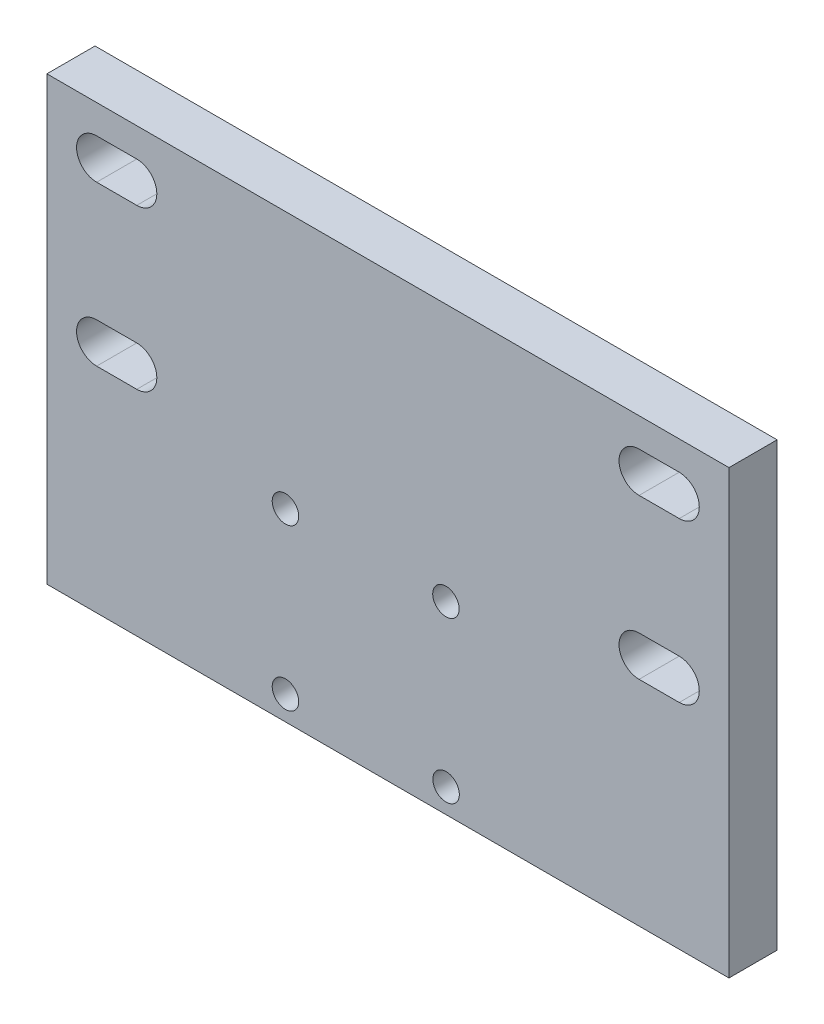
ISO-10303-21;
HEADER;
FILE_DESCRIPTION(('STEP AP214'),'2;1');
FILE_NAME('part.step','',(''),(''),'','','');
FILE_SCHEMA(('AUTOMOTIVE_DESIGN { 1 0 10303 214 1 1 1 1 }'));
ENDSEC;
DATA;
#1=APPLICATION_CONTEXT('core data for automotive mechanical design processes');
#2=APPLICATION_PROTOCOL_DEFINITION('international standard','automotive_design',2000,#1);
#3=PRODUCT_CONTEXT('',#1,'mechanical');
#4=PRODUCT('Part','Part','',(#3));
#5=PRODUCT_RELATED_PRODUCT_CATEGORY('part','',(#4));
#6=PRODUCT_DEFINITION_FORMATION('','',#4);
#7=PRODUCT_DEFINITION_CONTEXT('part definition',#1,'design');
#8=PRODUCT_DEFINITION('design','',#6,#7);
#9=PRODUCT_DEFINITION_SHAPE('','',#8);
#10=(LENGTH_UNIT() NAMED_UNIT(*) SI_UNIT(.MILLI.,.METRE.));
#11=(NAMED_UNIT(*) PLANE_ANGLE_UNIT() SI_UNIT($,.RADIAN.));
#12=(NAMED_UNIT(*) SI_UNIT($,.STERADIAN.) SOLID_ANGLE_UNIT());
#13=UNCERTAINTY_MEASURE_WITH_UNIT(LENGTH_MEASURE(1.E-05),#10,'distance_accuracy_value','');
#14=(GEOMETRIC_REPRESENTATION_CONTEXT(3) GLOBAL_UNCERTAINTY_ASSIGNED_CONTEXT((#13)) GLOBAL_UNIT_ASSIGNED_CONTEXT((#10,
#11,#12)) REPRESENTATION_CONTEXT('',''));
#15=CARTESIAN_POINT('',(0.,0.,0.));
#16=DIRECTION('',(0.,0.,1.));
#17=DIRECTION('',(1.,0.,0.));
#18=AXIS2_PLACEMENT_3D('',#15,#16,#17);
#19=CARTESIAN_POINT('',(0.,0.,6.));
#20=DIRECTION('',(0.,0.,1.));
#21=DIRECTION('',(1.,0.,0.));
#22=AXIS2_PLACEMENT_3D('',#19,#20,#21);
#23=PLANE('',#22);
#24=CARTESIAN_POINT('',(-10.2687894607377,-36.1316136019067,6.));
#25=DIRECTION('',(0.,0.,1.));
#26=DIRECTION('',(1.,0.,0.));
#27=AXIS2_PLACEMENT_3D('',#24,#25,#26);
#28=CIRCLE('',#27,1.65);
#29=CARTESIAN_POINT('',(-8.61878946073774,-36.1316136019067,6.));
#30=VERTEX_POINT('',#29);
#31=EDGE_CURVE('E324',#30,#30,#28,.T.);
#32=ORIENTED_EDGE('',*,*,#31,.F.);
#33=EDGE_LOOP('',(#32));
#34=FACE_BOUND('',#33,.T.);
#35=CARTESIAN_POINT('',(-10.2687894607377,-16.1316136019067,6.));
#36=DIRECTION('',(0.,0.,1.));
#37=DIRECTION('',(1.,0.,0.));
#38=AXIS2_PLACEMENT_3D('',#35,#36,#37);
#39=CIRCLE('',#38,1.65);
#40=CARTESIAN_POINT('',(-8.61878946073774,-16.1316136019067,6.));
#41=VERTEX_POINT('',#40);
#42=EDGE_CURVE('E325',#41,#41,#39,.T.);
#43=ORIENTED_EDGE('',*,*,#42,.F.);
#44=EDGE_LOOP('',(#43));
#45=FACE_BOUND('',#44,.T.);
#46=DIRECTION('',(0.,-1.,0.));
#47=VECTOR('',#46,1.);
#48=CARTESIAN_POINT('',(-40.,15.9473463451879,6.));
#49=LINE('',#48,#47);
#50=CARTESIAN_POINT('',(-40.,15.9473463451879,6.));
#51=VERTEX_POINT('',#50);
#52=CARTESIAN_POINT('',(-40.,-39.1363463064482,6.));
#53=VERTEX_POINT('',#52);
#54=EDGE_CURVE('E339',#51,#53,#49,.T.);
#55=ORIENTED_EDGE('',*,*,#54,.T.);
#56=DIRECTION('',(1.,0.,0.));
#57=VECTOR('',#56,1.);
#58=CARTESIAN_POINT('',(-40.,-39.1363463064482,6.));
#59=LINE('',#58,#57);
#60=CARTESIAN_POINT('',(45.,-39.1363463064482,6.));
#61=VERTEX_POINT('',#60);
#62=EDGE_CURVE('E344',#53,#61,#59,.T.);
#63=ORIENTED_EDGE('',*,*,#62,.T.);
#64=DIRECTION('',(0.,1.,0.));
#65=VECTOR('',#64,1.);
#66=CARTESIAN_POINT('',(45.,15.9473463451879,6.));
#67=LINE('',#66,#65);
#68=CARTESIAN_POINT('',(45.,15.9473463451879,6.));
#69=VERTEX_POINT('',#68);
#70=EDGE_CURVE('E351',#61,#69,#67,.T.);
#71=ORIENTED_EDGE('',*,*,#70,.T.);
#72=DIRECTION('',(-1.,0.,0.));
#73=VECTOR('',#72,1.);
#74=CARTESIAN_POINT('',(-40.,15.9473463451879,6.));
#75=LINE('',#74,#73);
#76=EDGE_CURVE('E355',#69,#51,#75,.T.);
#77=ORIENTED_EDGE('',*,*,#76,.T.);
#78=EDGE_LOOP('',(#55,#63,#71,#77));
#79=FACE_BOUND('',#78,.T.);
#80=DIRECTION('',(-1.,0.,0.));
#81=VECTOR('',#80,1.);
#82=CARTESIAN_POINT('',(38.8,12.35,6.));
#83=LINE('',#82,#81);
#84=CARTESIAN_POINT('',(38.8,12.35,6.));
#85=VERTEX_POINT('',#84);
#86=CARTESIAN_POINT('',(33.8,12.35,6.));
#87=VERTEX_POINT('',#86);
#88=EDGE_CURVE('E362',#85,#87,#83,.T.);
#89=ORIENTED_EDGE('',*,*,#88,.F.);
#90=CARTESIAN_POINT('',(38.8,9.85000000000004,6.));
#91=DIRECTION('',(0.,0.,1.));
#92=DIRECTION('',(-1.,0.,0.));
#93=AXIS2_PLACEMENT_3D('',#90,#91,#92);
#94=CIRCLE('',#93,2.50000000000001);
#95=CARTESIAN_POINT('',(38.8,7.35000000000001,6.));
#96=VERTEX_POINT('',#95);
#97=EDGE_CURVE('E366',#96,#85,#94,.T.);
#98=ORIENTED_EDGE('',*,*,#97,.F.);
#99=DIRECTION('',(1.,0.,0.));
#100=VECTOR('',#99,1.);
#101=CARTESIAN_POINT('',(38.8,7.35000000000001,6.));
#102=LINE('',#101,#100);
#103=CARTESIAN_POINT('',(33.8,7.35000000000001,6.));
#104=VERTEX_POINT('',#103);
#105=EDGE_CURVE('E372',#104,#96,#102,.T.);
#106=ORIENTED_EDGE('',*,*,#105,.F.);
#107=CARTESIAN_POINT('',(33.8,9.85000000000004,6.));
#108=DIRECTION('',(0.,0.,1.));
#109=DIRECTION('',(-1.,0.,0.));
#110=AXIS2_PLACEMENT_3D('',#107,#108,#109);
#111=CIRCLE('',#110,2.50000000000001);
#112=EDGE_CURVE('E365',#87,#104,#111,.T.);
#113=ORIENTED_EDGE('',*,*,#112,.F.);
#114=EDGE_LOOP('',(#89,#98,#106,#113));
#115=FACE_BOUND('',#114,.T.);
#116=CARTESIAN_POINT('',(9.73121053926226,-16.1316136019067,6.));
#117=DIRECTION('',(0.,0.,1.));
#118=DIRECTION('',(1.,0.,0.));
#119=AXIS2_PLACEMENT_3D('',#116,#117,#118);
#120=CIRCLE('',#119,1.65);
#121=CARTESIAN_POINT('',(11.3812105392623,-16.1316136019067,6.));
#122=VERTEX_POINT('',#121);
#123=EDGE_CURVE('E314',#122,#122,#120,.T.);
#124=ORIENTED_EDGE('',*,*,#123,.F.);
#125=EDGE_LOOP('',(#124));
#126=FACE_BOUND('',#125,.T.);
#127=CARTESIAN_POINT('',(9.74773228175577,-36.1316136019067,6.));
#128=DIRECTION('',(0.,0.,1.));
#129=DIRECTION('',(1.,0.,0.));
#130=AXIS2_PLACEMENT_3D('',#127,#128,#129);
#131=CIRCLE('',#130,1.65);
#132=CARTESIAN_POINT('',(11.3977322817558,-36.1316136019067,6.));
#133=VERTEX_POINT('',#132);
#134=EDGE_CURVE('E302',#133,#133,#131,.T.);
#135=ORIENTED_EDGE('',*,*,#134,.F.);
#136=EDGE_LOOP('',(#135));
#137=FACE_BOUND('',#136,.T.);
#138=DIRECTION('',(1.,0.,0.));
#139=VECTOR('',#138,1.);
#140=CARTESIAN_POINT('',(-33.8,7.35,6.));
#141=LINE('',#140,#139);
#142=CARTESIAN_POINT('',(-33.8,7.35,6.));
#143=VERTEX_POINT('',#142);
#144=CARTESIAN_POINT('',(-28.8,7.35000000000002,6.));
#145=VERTEX_POINT('',#144);
#146=EDGE_CURVE('E266',#143,#145,#141,.T.);
#147=ORIENTED_EDGE('',*,*,#146,.F.);
#148=CARTESIAN_POINT('',(-33.8,9.85000000000001,6.));
#149=DIRECTION('',(0.,0.,1.));
#150=DIRECTION('',(1.,0.,0.));
#151=AXIS2_PLACEMENT_3D('',#148,#149,#150);
#152=CIRCLE('',#151,2.50000000000001);
#153=CARTESIAN_POINT('',(-33.8,12.35,6.));
#154=VERTEX_POINT('',#153);
#155=EDGE_CURVE('E262',#154,#143,#152,.T.);
#156=ORIENTED_EDGE('',*,*,#155,.F.);
#157=DIRECTION('',(-1.,0.,0.));
#158=VECTOR('',#157,1.);
#159=CARTESIAN_POINT('',(-33.8,12.35,6.));
#160=LINE('',#159,#158);
#161=CARTESIAN_POINT('',(-28.8,12.35,6.));
#162=VERTEX_POINT('',#161);
#163=EDGE_CURVE('E275',#162,#154,#160,.T.);
#164=ORIENTED_EDGE('',*,*,#163,.F.);
#165=CARTESIAN_POINT('',(-28.8,9.85000000000003,6.));
#166=DIRECTION('',(0.,0.,1.));
#167=DIRECTION('',(1.,0.,0.));
#168=AXIS2_PLACEMENT_3D('',#165,#166,#167);
#169=CIRCLE('',#168,2.50000000000001);
#170=EDGE_CURVE('E280',#145,#162,#169,.T.);
#171=ORIENTED_EDGE('',*,*,#170,.F.);
#172=EDGE_LOOP('',(#147,#156,#164,#171));
#173=FACE_BOUND('',#172,.T.);
#174=DIRECTION('',(1.,0.,0.));
#175=VECTOR('',#174,1.);
#176=CARTESIAN_POINT('',(-33.8,-12.5,6.));
#177=LINE('',#176,#175);
#178=CARTESIAN_POINT('',(-33.8,-12.5,6.));
#179=VERTEX_POINT('',#178);
#180=CARTESIAN_POINT('',(-28.8,-12.5,6.));
#181=VERTEX_POINT('',#180);
#182=EDGE_CURVE('E228',#179,#181,#177,.T.);
#183=ORIENTED_EDGE('',*,*,#182,.F.);
#184=CARTESIAN_POINT('',(-33.8,-9.99999999999999,6.));
#185=DIRECTION('',(0.,0.,1.));
#186=DIRECTION('',(1.,0.,0.));
#187=AXIS2_PLACEMENT_3D('',#184,#185,#186);
#188=CIRCLE('',#187,2.5);
#189=CARTESIAN_POINT('',(-33.8,-7.5,6.));
#190=VERTEX_POINT('',#189);
#191=EDGE_CURVE('E224',#190,#179,#188,.T.);
#192=ORIENTED_EDGE('',*,*,#191,.F.);
#193=DIRECTION('',(-1.,0.,0.));
#194=VECTOR('',#193,1.);
#195=CARTESIAN_POINT('',(-33.8,-7.5,6.));
#196=LINE('',#195,#194);
#197=CARTESIAN_POINT('',(-28.8,-7.49999999999999,6.));
#198=VERTEX_POINT('',#197);
#199=EDGE_CURVE('E235',#198,#190,#196,.T.);
#200=ORIENTED_EDGE('',*,*,#199,.F.);
#201=CARTESIAN_POINT('',(-28.8,-9.99999999999999,6.));
#202=DIRECTION('',(0.,0.,1.));
#203=DIRECTION('',(1.,0.,0.));
#204=AXIS2_PLACEMENT_3D('',#201,#202,#203);
#205=CIRCLE('',#204,2.5);
#206=EDGE_CURVE('E240',#181,#198,#205,.T.);
#207=ORIENTED_EDGE('',*,*,#206,.F.);
#208=EDGE_LOOP('',(#183,#192,#200,#207));
#209=FACE_BOUND('',#208,.T.);
#210=DIRECTION('',(-1.,0.,0.));
#211=VECTOR('',#210,1.);
#212=CARTESIAN_POINT('',(38.8,-7.49999999999999,6.));
#213=LINE('',#212,#211);
#214=CARTESIAN_POINT('',(38.8,-7.49999999999999,6.));
#215=VERTEX_POINT('',#214);
#216=CARTESIAN_POINT('',(33.8,-7.49999999999999,6.));
#217=VERTEX_POINT('',#216);
#218=EDGE_CURVE('E184',#215,#217,#213,.T.);
#219=ORIENTED_EDGE('',*,*,#218,.F.);
#220=CARTESIAN_POINT('',(38.8,-9.99999999999999,6.));
#221=DIRECTION('',(0.,0.,1.));
#222=DIRECTION('',(-1.,0.,0.));
#223=AXIS2_PLACEMENT_3D('',#220,#221,#222);
#224=CIRCLE('',#223,2.5);
#225=CARTESIAN_POINT('',(38.8,-12.5,6.));
#226=VERTEX_POINT('',#225);
#227=EDGE_CURVE('E175',#226,#215,#224,.T.);
#228=ORIENTED_EDGE('',*,*,#227,.F.);
#229=DIRECTION('',(1.,0.,0.));
#230=VECTOR('',#229,1.);
#231=CARTESIAN_POINT('',(38.8,-12.5,6.));
#232=LINE('',#231,#230);
#233=CARTESIAN_POINT('',(33.8,-12.5,6.));
#234=VERTEX_POINT('',#233);
#235=EDGE_CURVE('E201',#234,#226,#232,.T.);
#236=ORIENTED_EDGE('',*,*,#235,.F.);
#237=CARTESIAN_POINT('',(33.8,-9.99999999999999,6.));
#238=DIRECTION('',(0.,0.,1.));
#239=DIRECTION('',(-1.,0.,0.));
#240=AXIS2_PLACEMENT_3D('',#237,#238,#239);
#241=CIRCLE('',#240,2.5);
#242=EDGE_CURVE('E196',#217,#234,#241,.T.);
#243=ORIENTED_EDGE('',*,*,#242,.F.);
#244=EDGE_LOOP('',(#219,#228,#236,#243));
#245=FACE_BOUND('',#244,.T.);
#246=ADVANCED_FACE('F38',(#34,#45,#79,#115,#126,#137,#173,#209,#245),#23,.T.);
#247=CARTESIAN_POINT('',(0.,0.,0.));
#248=DIRECTION('',(0.,0.,1.));
#249=DIRECTION('',(1.,0.,0.));
#250=AXIS2_PLACEMENT_3D('',#247,#248,#249);
#251=PLANE('',#250);
#252=CARTESIAN_POINT('',(-33.8,-9.99999999999999,0.));
#253=DIRECTION('',(0.,0.,1.));
#254=DIRECTION('',(1.,0.,0.));
#255=AXIS2_PLACEMENT_3D('',#252,#253,#254);
#256=CIRCLE('',#255,2.5);
#257=CARTESIAN_POINT('',(-33.8,-7.5,0.));
#258=VERTEX_POINT('',#257);
#259=CARTESIAN_POINT('',(-33.8,-12.5,0.));
#260=VERTEX_POINT('',#259);
#261=EDGE_CURVE('E192',#258,#260,#256,.T.);
#262=ORIENTED_EDGE('',*,*,#261,.T.);
#263=DIRECTION('',(1.,0.,0.));
#264=VECTOR('',#263,1.);
#265=CARTESIAN_POINT('',(-33.8,-12.5,0.));
#266=LINE('',#265,#264);
#267=CARTESIAN_POINT('',(-28.8,-12.5,0.));
#268=VERTEX_POINT('',#267);
#269=EDGE_CURVE('E244',#260,#268,#266,.T.);
#270=ORIENTED_EDGE('',*,*,#269,.T.);
#271=CARTESIAN_POINT('',(-28.8,-9.99999999999999,0.));
#272=DIRECTION('',(0.,0.,1.));
#273=DIRECTION('',(1.,0.,0.));
#274=AXIS2_PLACEMENT_3D('',#271,#272,#273);
#275=CIRCLE('',#274,2.5);
#276=CARTESIAN_POINT('',(-28.8,-7.49999999999999,0.));
#277=VERTEX_POINT('',#276);
#278=EDGE_CURVE('E247',#268,#277,#275,.T.);
#279=ORIENTED_EDGE('',*,*,#278,.T.);
#280=DIRECTION('',(-1.,0.,0.));
#281=VECTOR('',#280,1.);
#282=CARTESIAN_POINT('',(-33.8,-7.5,0.));
#283=LINE('',#282,#281);
#284=EDGE_CURVE('E229',#277,#258,#283,.T.);
#285=ORIENTED_EDGE('',*,*,#284,.T.);
#286=EDGE_LOOP('',(#262,#270,#279,#285));
#287=FACE_BOUND('',#286,.T.);
#288=CARTESIAN_POINT('',(9.74773228175577,-36.1316136019067,0.));
#289=DIRECTION('',(0.,0.,1.));
#290=DIRECTION('',(1.,0.,0.));
#291=AXIS2_PLACEMENT_3D('',#288,#289,#290);
#292=CIRCLE('',#291,1.65);
#293=CARTESIAN_POINT('',(11.3977322817558,-36.1316136019067,0.));
#294=VERTEX_POINT('',#293);
#295=EDGE_CURVE('E301',#294,#294,#292,.T.);
#296=ORIENTED_EDGE('',*,*,#295,.T.);
#297=EDGE_LOOP('',(#296));
#298=FACE_BOUND('',#297,.T.);
#299=CARTESIAN_POINT('',(-10.2687894607377,-36.1316136019067,0.));
#300=DIRECTION('',(0.,0.,1.));
#301=DIRECTION('',(1.,0.,0.));
#302=AXIS2_PLACEMENT_3D('',#299,#300,#301);
#303=CIRCLE('',#302,1.65);
#304=CARTESIAN_POINT('',(-8.61878946073774,-36.1316136019067,0.));
#305=VERTEX_POINT('',#304);
#306=EDGE_CURVE('E307',#305,#305,#303,.T.);
#307=ORIENTED_EDGE('',*,*,#306,.T.);
#308=EDGE_LOOP('',(#307));
#309=FACE_BOUND('',#308,.T.);
#310=CARTESIAN_POINT('',(9.73121053926226,-16.1316136019067,0.));
#311=DIRECTION('',(0.,0.,1.));
#312=DIRECTION('',(1.,0.,0.));
#313=AXIS2_PLACEMENT_3D('',#310,#311,#312);
#314=CIRCLE('',#313,1.65);
#315=CARTESIAN_POINT('',(11.3812105392623,-16.1316136019067,0.));
#316=VERTEX_POINT('',#315);
#317=EDGE_CURVE('E321',#316,#316,#314,.T.);
#318=ORIENTED_EDGE('',*,*,#317,.T.);
#319=EDGE_LOOP('',(#318));
#320=FACE_BOUND('',#319,.T.);
#321=CARTESIAN_POINT('',(-10.2687894607377,-16.1316136019067,0.));
#322=DIRECTION('',(0.,0.,1.));
#323=DIRECTION('',(1.,0.,0.));
#324=AXIS2_PLACEMENT_3D('',#321,#322,#323);
#325=CIRCLE('',#324,1.65);
#326=CARTESIAN_POINT('',(-8.61878946073774,-16.1316136019067,0.));
#327=VERTEX_POINT('',#326);
#328=EDGE_CURVE('E320',#327,#327,#325,.T.);
#329=ORIENTED_EDGE('',*,*,#328,.T.);
#330=EDGE_LOOP('',(#329));
#331=FACE_BOUND('',#330,.T.);
#332=CARTESIAN_POINT('',(38.8,9.85000000000004,0.));
#333=DIRECTION('',(0.,0.,1.));
#334=DIRECTION('',(-1.,0.,0.));
#335=AXIS2_PLACEMENT_3D('',#332,#333,#334);
#336=CIRCLE('',#335,2.50000000000001);
#337=CARTESIAN_POINT('',(38.8,7.35000000000001,0.));
#338=VERTEX_POINT('',#337);
#339=CARTESIAN_POINT('',(38.8,12.35,0.));
#340=VERTEX_POINT('',#339);
#341=EDGE_CURVE('E330',#338,#340,#336,.T.);
#342=ORIENTED_EDGE('',*,*,#341,.T.);
#343=DIRECTION('',(-1.,0.,0.));
#344=VECTOR('',#343,1.);
#345=CARTESIAN_POINT('',(38.8,12.35,0.));
#346=LINE('',#345,#344);
#347=CARTESIAN_POINT('',(33.8,12.35,0.));
#348=VERTEX_POINT('',#347);
#349=EDGE_CURVE('E379',#340,#348,#346,.T.);
#350=ORIENTED_EDGE('',*,*,#349,.T.);
#351=CARTESIAN_POINT('',(33.8,9.85000000000004,0.));
#352=DIRECTION('',(0.,0.,1.));
#353=DIRECTION('',(-1.,0.,0.));
#354=AXIS2_PLACEMENT_3D('',#351,#352,#353);
#355=CIRCLE('',#354,2.50000000000001);
#356=CARTESIAN_POINT('',(33.8,7.35000000000003,0.));
#357=VERTEX_POINT('',#356);
#358=EDGE_CURVE('E382',#348,#357,#355,.T.);
#359=ORIENTED_EDGE('',*,*,#358,.T.);
#360=DIRECTION('',(1.,0.,0.));
#361=VECTOR('',#360,1.);
#362=CARTESIAN_POINT('',(38.8,7.35000000000001,0.));
#363=LINE('',#362,#361);
#364=EDGE_CURVE('E385',#357,#338,#363,.T.);
#365=ORIENTED_EDGE('',*,*,#364,.T.);
#366=EDGE_LOOP('',(#342,#350,#359,#365));
#367=FACE_BOUND('',#366,.T.);
#368=DIRECTION('',(0.,-1.,0.));
#369=VECTOR('',#368,1.);
#370=CARTESIAN_POINT('',(-40.,15.9473463451879,0.));
#371=LINE('',#370,#369);
#372=CARTESIAN_POINT('',(-40.,15.9473463451879,0.));
#373=VERTEX_POINT('',#372);
#374=CARTESIAN_POINT('',(-40.,-39.1363463064482,0.));
#375=VERTEX_POINT('',#374);
#376=EDGE_CURVE('E396',#373,#375,#371,.T.);
#377=ORIENTED_EDGE('',*,*,#376,.F.);
#378=DIRECTION('',(-1.,0.,0.));
#379=VECTOR('',#378,1.);
#380=CARTESIAN_POINT('',(-40.,15.9473463451879,0.));
#381=LINE('',#380,#379);
#382=CARTESIAN_POINT('',(45.,15.9473463451879,0.));
#383=VERTEX_POINT('',#382);
#384=EDGE_CURVE('E345',#383,#373,#381,.T.);
#385=ORIENTED_EDGE('',*,*,#384,.F.);
#386=DIRECTION('',(0.,1.,0.));
#387=VECTOR('',#386,1.);
#388=CARTESIAN_POINT('',(45.,15.9473463451879,0.));
#389=LINE('',#388,#387);
#390=CARTESIAN_POINT('',(45.,-39.1363463064482,0.));
#391=VERTEX_POINT('',#390);
#392=EDGE_CURVE('E405',#391,#383,#389,.T.);
#393=ORIENTED_EDGE('',*,*,#392,.F.);
#394=DIRECTION('',(1.,0.,0.));
#395=VECTOR('',#394,1.);
#396=CARTESIAN_POINT('',(-40.,-39.1363463064482,0.));
#397=LINE('',#396,#395);
#398=EDGE_CURVE('E400',#375,#391,#397,.T.);
#399=ORIENTED_EDGE('',*,*,#398,.F.);
#400=EDGE_LOOP('',(#377,#385,#393,#399));
#401=FACE_BOUND('',#400,.T.);
#402=CARTESIAN_POINT('',(-33.8,9.85000000000001,0.));
#403=DIRECTION('',(0.,0.,1.));
#404=DIRECTION('',(1.,0.,0.));
#405=AXIS2_PLACEMENT_3D('',#402,#403,#404);
#406=CIRCLE('',#405,2.50000000000001);
#407=CARTESIAN_POINT('',(-33.8,12.35,0.));
#408=VERTEX_POINT('',#407);
#409=CARTESIAN_POINT('',(-33.8,7.35,0.));
#410=VERTEX_POINT('',#409);
#411=EDGE_CURVE('E261',#408,#410,#406,.T.);
#412=ORIENTED_EDGE('',*,*,#411,.T.);
#413=DIRECTION('',(1.,0.,0.));
#414=VECTOR('',#413,1.);
#415=CARTESIAN_POINT('',(-33.8,7.35,0.));
#416=LINE('',#415,#414);
#417=CARTESIAN_POINT('',(-28.8,7.35000000000002,0.));
#418=VERTEX_POINT('',#417);
#419=EDGE_CURVE('E284',#410,#418,#416,.T.);
#420=ORIENTED_EDGE('',*,*,#419,.T.);
#421=CARTESIAN_POINT('',(-28.8,9.85000000000003,0.));
#422=DIRECTION('',(0.,0.,1.));
#423=DIRECTION('',(1.,0.,0.));
#424=AXIS2_PLACEMENT_3D('',#421,#422,#423);
#425=CIRCLE('',#424,2.50000000000001);
#426=CARTESIAN_POINT('',(-28.8,12.35,0.));
#427=VERTEX_POINT('',#426);
#428=EDGE_CURVE('E287',#418,#427,#425,.T.);
#429=ORIENTED_EDGE('',*,*,#428,.T.);
#430=DIRECTION('',(-1.,0.,0.));
#431=VECTOR('',#430,1.);
#432=CARTESIAN_POINT('',(-33.8,12.35,0.));
#433=LINE('',#432,#431);
#434=EDGE_CURVE('E267',#427,#408,#433,.T.);
#435=ORIENTED_EDGE('',*,*,#434,.T.);
#436=EDGE_LOOP('',(#412,#420,#429,#435));
#437=FACE_BOUND('',#436,.T.);
#438=CARTESIAN_POINT('',(38.8,-9.99999999999999,0.));
#439=DIRECTION('',(0.,0.,1.));
#440=DIRECTION('',(-1.,0.,0.));
#441=AXIS2_PLACEMENT_3D('',#438,#439,#440);
#442=CIRCLE('',#441,2.5);
#443=CARTESIAN_POINT('',(38.8,-12.5,0.));
#444=VERTEX_POINT('',#443);
#445=CARTESIAN_POINT('',(38.8,-7.49999999999999,0.));
#446=VERTEX_POINT('',#445);
#447=EDGE_CURVE('E61',#444,#446,#442,.T.);
#448=ORIENTED_EDGE('',*,*,#447,.T.);
#449=DIRECTION('',(-1.,0.,0.));
#450=VECTOR('',#449,1.);
#451=CARTESIAN_POINT('',(38.8,-7.49999999999999,0.));
#452=LINE('',#451,#450);
#453=CARTESIAN_POINT('',(33.8,-7.49999999999999,0.));
#454=VERTEX_POINT('',#453);
#455=EDGE_CURVE('E191',#446,#454,#452,.T.);
#456=ORIENTED_EDGE('',*,*,#455,.T.);
#457=CARTESIAN_POINT('',(33.8,-9.99999999999999,0.));
#458=DIRECTION('',(0.,0.,1.));
#459=DIRECTION('',(-1.,0.,0.));
#460=AXIS2_PLACEMENT_3D('',#457,#458,#459);
#461=CIRCLE('',#460,2.5);
#462=CARTESIAN_POINT('',(33.8,-12.5,0.));
#463=VERTEX_POINT('',#462);
#464=EDGE_CURVE('E216',#454,#463,#461,.T.);
#465=ORIENTED_EDGE('',*,*,#464,.T.);
#466=DIRECTION('',(1.,0.,0.));
#467=VECTOR('',#466,1.);
#468=CARTESIAN_POINT('',(38.8,-12.5,0.));
#469=LINE('',#468,#467);
#470=EDGE_CURVE('E185',#463,#444,#469,.T.);
#471=ORIENTED_EDGE('',*,*,#470,.T.);
#472=EDGE_LOOP('',(#448,#456,#465,#471));
#473=FACE_BOUND('',#472,.T.);
#474=ADVANCED_FACE('F424',(#287,#298,#309,#320,#331,#367,#401,#437,#473),#251,.F.);
#475=CARTESIAN_POINT('',(-40.,15.9473463451879,6.));
#476=DIRECTION('',(1.,0.,0.));
#477=DIRECTION('',(0.,0.,-1.));
#478=AXIS2_PLACEMENT_3D('',#475,#476,#477);
#479=PLANE('',#478);
#480=ORIENTED_EDGE('',*,*,#376,.T.);
#481=DIRECTION('',(0.,0.,-1.));
#482=VECTOR('',#481,1.);
#483=CARTESIAN_POINT('',(-40.,-39.1363463064482,6.));
#484=LINE('',#483,#482);
#485=EDGE_CURVE('E12',#53,#375,#484,.T.);
#486=ORIENTED_EDGE('',*,*,#485,.F.);
#487=ORIENTED_EDGE('',*,*,#54,.F.);
#488=DIRECTION('',(0.,0.,-1.));
#489=VECTOR('',#488,1.);
#490=CARTESIAN_POINT('',(-40.,15.9473463451879,6.));
#491=LINE('',#490,#489);
#492=EDGE_CURVE('E410',#51,#373,#491,.T.);
#493=ORIENTED_EDGE('',*,*,#492,.T.);
#494=EDGE_LOOP('',(#480,#486,#487,#493));
#495=FACE_BOUND('',#494,.T.);
#496=ADVANCED_FACE('F40',(#495),#479,.F.);
#497=CARTESIAN_POINT('',(-40.,-39.1363463064482,6.));
#498=DIRECTION('',(0.,1.,0.));
#499=DIRECTION('',(-1.,0.,0.));
#500=AXIS2_PLACEMENT_3D('',#497,#498,#499);
#501=PLANE('',#500);
#502=ORIENTED_EDGE('',*,*,#398,.T.);
#503=DIRECTION('',(0.,0.,-1.));
#504=VECTOR('',#503,1.);
#505=CARTESIAN_POINT('',(45.,-39.1363463064482,6.));
#506=LINE('',#505,#504);
#507=EDGE_CURVE('E46',#61,#391,#506,.T.);
#508=ORIENTED_EDGE('',*,*,#507,.F.);
#509=ORIENTED_EDGE('',*,*,#62,.F.);
#510=ORIENTED_EDGE('',*,*,#485,.T.);
#511=EDGE_LOOP('',(#502,#508,#509,#510));
#512=FACE_BOUND('',#511,.T.);
#513=ADVANCED_FACE('F485',(#512),#501,.F.);
#514=CARTESIAN_POINT('',(45.,15.9473463451879,6.));
#515=DIRECTION('',(-1.,0.,0.));
#516=DIRECTION('',(0.,-1.,0.));
#517=AXIS2_PLACEMENT_3D('',#514,#515,#516);
#518=PLANE('',#517);
#519=ORIENTED_EDGE('',*,*,#392,.T.);
#520=DIRECTION('',(0.,0.,-1.));
#521=VECTOR('',#520,1.);
#522=CARTESIAN_POINT('',(45.,15.9473463451879,6.));
#523=LINE('',#522,#521);
#524=EDGE_CURVE('E412',#69,#383,#523,.T.);
#525=ORIENTED_EDGE('',*,*,#524,.F.);
#526=ORIENTED_EDGE('',*,*,#70,.F.);
#527=ORIENTED_EDGE('',*,*,#507,.T.);
#528=EDGE_LOOP('',(#519,#525,#526,#527));
#529=FACE_BOUND('',#528,.T.);
#530=ADVANCED_FACE('F419',(#529),#518,.F.);
#531=CARTESIAN_POINT('',(-40.,15.9473463451879,6.));
#532=DIRECTION('',(0.,-1.,0.));
#533=DIRECTION('',(1.,0.,0.));
#534=AXIS2_PLACEMENT_3D('',#531,#532,#533);
#535=PLANE('',#534);
#536=ORIENTED_EDGE('',*,*,#384,.T.);
#537=ORIENTED_EDGE('',*,*,#492,.F.);
#538=ORIENTED_EDGE('',*,*,#76,.F.);
#539=ORIENTED_EDGE('',*,*,#524,.T.);
#540=EDGE_LOOP('',(#536,#537,#538,#539));
#541=FACE_BOUND('',#540,.T.);
#542=ADVANCED_FACE('F428',(#541),#535,.F.);
#543=CARTESIAN_POINT('',(38.8,9.85000000000004,6.));
#544=DIRECTION('',(0.,0.,-1.));
#545=DIRECTION('',(-1.,0.,0.));
#546=AXIS2_PLACEMENT_3D('',#543,#544,#545);
#547=CYLINDRICAL_SURFACE('',#546,2.50000000000001);
#548=ORIENTED_EDGE('',*,*,#341,.F.);
#549=DIRECTION('',(0.,0.,-1.));
#550=VECTOR('',#549,1.);
#551=CARTESIAN_POINT('',(38.8,7.35000000000001,6.));
#552=LINE('',#551,#550);
#553=EDGE_CURVE('E376',#96,#338,#552,.T.);
#554=ORIENTED_EDGE('',*,*,#553,.F.);
#555=ORIENTED_EDGE('',*,*,#97,.T.);
#556=DIRECTION('',(0.,0.,-1.));
#557=VECTOR('',#556,1.);
#558=CARTESIAN_POINT('',(38.8,12.35,6.));
#559=LINE('',#558,#557);
#560=EDGE_CURVE('E346',#85,#340,#559,.T.);
#561=ORIENTED_EDGE('',*,*,#560,.T.);
#562=EDGE_LOOP('',(#548,#554,#555,#561));
#563=FACE_BOUND('',#562,.T.);
#564=ADVANCED_FACE('F479',(#563),#547,.F.);
#565=CARTESIAN_POINT('',(38.8,12.35,6.));
#566=DIRECTION('',(0.,-1.,0.));
#567=DIRECTION('',(0.,0.,-1.));
#568=AXIS2_PLACEMENT_3D('',#565,#566,#567);
#569=PLANE('',#568);
#570=ORIENTED_EDGE('',*,*,#349,.F.);
#571=ORIENTED_EDGE('',*,*,#560,.F.);
#572=ORIENTED_EDGE('',*,*,#88,.T.);
#573=DIRECTION('',(0.,0.,-1.));
#574=VECTOR('',#573,1.);
#575=CARTESIAN_POINT('',(33.8,12.35,6.));
#576=LINE('',#575,#574);
#577=EDGE_CURVE('E391',#87,#348,#576,.T.);
#578=ORIENTED_EDGE('',*,*,#577,.T.);
#579=EDGE_LOOP('',(#570,#571,#572,#578));
#580=FACE_BOUND('',#579,.T.);
#581=ADVANCED_FACE('F526',(#580),#569,.T.);
#582=CARTESIAN_POINT('',(33.8,9.85000000000004,6.));
#583=DIRECTION('',(0.,0.,-1.));
#584=DIRECTION('',(-1.,0.,0.));
#585=AXIS2_PLACEMENT_3D('',#582,#583,#584);
#586=CYLINDRICAL_SURFACE('',#585,2.50000000000001);
#587=ORIENTED_EDGE('',*,*,#358,.F.);
#588=ORIENTED_EDGE('',*,*,#577,.F.);
#589=ORIENTED_EDGE('',*,*,#112,.T.);
#590=DIRECTION('',(0.,0.,-1.));
#591=VECTOR('',#590,1.);
#592=CARTESIAN_POINT('',(33.8,7.35000000000003,6.));
#593=LINE('',#592,#591);
#594=EDGE_CURVE('E390',#104,#357,#593,.T.);
#595=ORIENTED_EDGE('',*,*,#594,.T.);
#596=EDGE_LOOP('',(#587,#588,#589,#595));
#597=FACE_BOUND('',#596,.T.);
#598=ADVANCED_FACE('F533',(#597),#586,.F.);
#599=CARTESIAN_POINT('',(38.8,7.35000000000001,6.));
#600=DIRECTION('',(0.,1.,0.));
#601=DIRECTION('',(-1.,0.,0.));
#602=AXIS2_PLACEMENT_3D('',#599,#600,#601);
#603=PLANE('',#602);
#604=ORIENTED_EDGE('',*,*,#364,.F.);
#605=ORIENTED_EDGE('',*,*,#594,.F.);
#606=ORIENTED_EDGE('',*,*,#105,.T.);
#607=ORIENTED_EDGE('',*,*,#553,.T.);
#608=EDGE_LOOP('',(#604,#605,#606,#607));
#609=FACE_BOUND('',#608,.T.);
#610=ADVANCED_FACE('F540',(#609),#603,.T.);
#611=CARTESIAN_POINT('',(-10.2687894607377,-16.1316136019067,6.));
#612=DIRECTION('',(0.,0.,-1.));
#613=DIRECTION('',(-1.,0.,0.));
#614=AXIS2_PLACEMENT_3D('',#611,#612,#613);
#615=CYLINDRICAL_SURFACE('',#614,1.65);
#616=ORIENTED_EDGE('',*,*,#42,.T.);
#617=EDGE_LOOP('',(#616));
#618=FACE_BOUND('',#617,.T.);
#619=ORIENTED_EDGE('',*,*,#328,.F.);
#620=EDGE_LOOP('',(#619));
#621=FACE_BOUND('',#620,.T.);
#622=ADVANCED_FACE('F549',(#618,#621),#615,.F.);
#623=CARTESIAN_POINT('',(9.73121053926226,-16.1316136019067,6.));
#624=DIRECTION('',(0.,0.,-1.));
#625=DIRECTION('',(-1.,0.,0.));
#626=AXIS2_PLACEMENT_3D('',#623,#624,#625);
#627=CYLINDRICAL_SURFACE('',#626,1.65);
#628=ORIENTED_EDGE('',*,*,#123,.T.);
#629=EDGE_LOOP('',(#628));
#630=FACE_BOUND('',#629,.T.);
#631=ORIENTED_EDGE('',*,*,#317,.F.);
#632=EDGE_LOOP('',(#631));
#633=FACE_BOUND('',#632,.T.);
#634=ADVANCED_FACE('F558',(#630,#633),#627,.F.);
#635=CARTESIAN_POINT('',(-10.2687894607377,-36.1316136019067,6.));
#636=DIRECTION('',(0.,0.,-1.));
#637=DIRECTION('',(-1.,0.,0.));
#638=AXIS2_PLACEMENT_3D('',#635,#636,#637);
#639=CYLINDRICAL_SURFACE('',#638,1.65);
#640=ORIENTED_EDGE('',*,*,#31,.T.);
#641=EDGE_LOOP('',(#640));
#642=FACE_BOUND('',#641,.T.);
#643=ORIENTED_EDGE('',*,*,#306,.F.);
#644=EDGE_LOOP('',(#643));
#645=FACE_BOUND('',#644,.T.);
#646=ADVANCED_FACE('F567',(#642,#645),#639,.F.);
#647=CARTESIAN_POINT('',(9.74773228175577,-36.1316136019067,6.));
#648=DIRECTION('',(0.,0.,-1.));
#649=DIRECTION('',(-1.,0.,0.));
#650=AXIS2_PLACEMENT_3D('',#647,#648,#649);
#651=CYLINDRICAL_SURFACE('',#650,1.65);
#652=ORIENTED_EDGE('',*,*,#134,.T.);
#653=EDGE_LOOP('',(#652));
#654=FACE_BOUND('',#653,.T.);
#655=ORIENTED_EDGE('',*,*,#295,.F.);
#656=EDGE_LOOP('',(#655));
#657=FACE_BOUND('',#656,.T.);
#658=ADVANCED_FACE('F576',(#654,#657),#651,.F.);
#659=CARTESIAN_POINT('',(-33.8,9.85000000000001,6.));
#660=DIRECTION('',(0.,0.,-1.));
#661=DIRECTION('',(-1.,0.,0.));
#662=AXIS2_PLACEMENT_3D('',#659,#660,#661);
#663=CYLINDRICAL_SURFACE('',#662,2.50000000000001);
#664=ORIENTED_EDGE('',*,*,#411,.F.);
#665=DIRECTION('',(0.,0.,-1.));
#666=VECTOR('',#665,1.);
#667=CARTESIAN_POINT('',(-33.8,12.35,6.));
#668=LINE('',#667,#666);
#669=EDGE_CURVE('E279',#154,#408,#668,.T.);
#670=ORIENTED_EDGE('',*,*,#669,.F.);
#671=ORIENTED_EDGE('',*,*,#155,.T.);
#672=DIRECTION('',(0.,0.,-1.));
#673=VECTOR('',#672,1.);
#674=CARTESIAN_POINT('',(-33.8,7.35,6.));
#675=LINE('',#674,#673);
#676=EDGE_CURVE('E298',#143,#410,#675,.T.);
#677=ORIENTED_EDGE('',*,*,#676,.T.);
#678=EDGE_LOOP('',(#664,#670,#671,#677));
#679=FACE_BOUND('',#678,.T.);
#680=ADVANCED_FACE('F585',(#679),#663,.F.);
#681=CARTESIAN_POINT('',(-33.8,7.35,6.));
#682=DIRECTION('',(0.,1.,0.));
#683=DIRECTION('',(0.,0.,1.));
#684=AXIS2_PLACEMENT_3D('',#681,#682,#683);
#685=PLANE('',#684);
#686=ORIENTED_EDGE('',*,*,#419,.F.);
#687=ORIENTED_EDGE('',*,*,#676,.F.);
#688=ORIENTED_EDGE('',*,*,#146,.T.);
#689=DIRECTION('',(0.,0.,-1.));
#690=VECTOR('',#689,1.);
#691=CARTESIAN_POINT('',(-28.8,7.35000000000002,6.));
#692=LINE('',#691,#690);
#693=EDGE_CURVE('E296',#145,#418,#692,.T.);
#694=ORIENTED_EDGE('',*,*,#693,.T.);
#695=EDGE_LOOP('',(#686,#687,#688,#694));
#696=FACE_BOUND('',#695,.T.);
#697=ADVANCED_FACE('F594',(#696),#685,.T.);
#698=CARTESIAN_POINT('',(-28.8,9.85000000000003,6.));
#699=DIRECTION('',(0.,0.,-1.));
#700=DIRECTION('',(-1.,0.,0.));
#701=AXIS2_PLACEMENT_3D('',#698,#699,#700);
#702=CYLINDRICAL_SURFACE('',#701,2.50000000000001);
#703=ORIENTED_EDGE('',*,*,#428,.F.);
#704=ORIENTED_EDGE('',*,*,#693,.F.);
#705=ORIENTED_EDGE('',*,*,#170,.T.);
#706=DIRECTION('',(0.,0.,-1.));
#707=VECTOR('',#706,1.);
#708=CARTESIAN_POINT('',(-28.8,12.35,6.));
#709=LINE('',#708,#707);
#710=EDGE_CURVE('E294',#162,#427,#709,.T.);
#711=ORIENTED_EDGE('',*,*,#710,.T.);
#712=EDGE_LOOP('',(#703,#704,#705,#711));
#713=FACE_BOUND('',#712,.T.);
#714=ADVANCED_FACE('F603',(#713),#702,.F.);
#715=CARTESIAN_POINT('',(-33.8,12.35,6.));
#716=DIRECTION('',(0.,-1.,0.));
#717=DIRECTION('',(1.,0.,0.));
#718=AXIS2_PLACEMENT_3D('',#715,#716,#717);
#719=PLANE('',#718);
#720=ORIENTED_EDGE('',*,*,#434,.F.);
#721=ORIENTED_EDGE('',*,*,#710,.F.);
#722=ORIENTED_EDGE('',*,*,#163,.T.);
#723=ORIENTED_EDGE('',*,*,#669,.T.);
#724=EDGE_LOOP('',(#720,#721,#722,#723));
#725=FACE_BOUND('',#724,.T.);
#726=ADVANCED_FACE('F467',(#725),#719,.T.);
#727=CARTESIAN_POINT('',(-33.8,-9.99999999999999,6.));
#728=DIRECTION('',(0.,0.,-1.));
#729=DIRECTION('',(-1.,0.,0.));
#730=AXIS2_PLACEMENT_3D('',#727,#728,#729);
#731=CYLINDRICAL_SURFACE('',#730,2.5);
#732=ORIENTED_EDGE('',*,*,#261,.F.);
#733=DIRECTION('',(0.,0.,-1.));
#734=VECTOR('',#733,1.);
#735=CARTESIAN_POINT('',(-33.8,-7.5,6.));
#736=LINE('',#735,#734);
#737=EDGE_CURVE('E239',#190,#258,#736,.T.);
#738=ORIENTED_EDGE('',*,*,#737,.F.);
#739=ORIENTED_EDGE('',*,*,#191,.T.);
#740=DIRECTION('',(0.,0.,-1.));
#741=VECTOR('',#740,1.);
#742=CARTESIAN_POINT('',(-33.8,-12.5,6.));
#743=LINE('',#742,#741);
#744=EDGE_CURVE('E258',#179,#260,#743,.T.);
#745=ORIENTED_EDGE('',*,*,#744,.T.);
#746=EDGE_LOOP('',(#732,#738,#739,#745));
#747=FACE_BOUND('',#746,.T.);
#748=ADVANCED_FACE('F454',(#747),#731,.F.);
#749=CARTESIAN_POINT('',(-33.8,-12.5,6.));
#750=DIRECTION('',(0.,1.,0.));
#751=DIRECTION('',(-1.,0.,0.));
#752=AXIS2_PLACEMENT_3D('',#749,#750,#751);
#753=PLANE('',#752);
#754=ORIENTED_EDGE('',*,*,#269,.F.);
#755=ORIENTED_EDGE('',*,*,#744,.F.);
#756=ORIENTED_EDGE('',*,*,#182,.T.);
#757=DIRECTION('',(0.,0.,-1.));
#758=VECTOR('',#757,1.);
#759=CARTESIAN_POINT('',(-28.8,-12.5,6.));
#760=LINE('',#759,#758);
#761=EDGE_CURVE('E256',#181,#268,#760,.T.);
#762=ORIENTED_EDGE('',*,*,#761,.T.);
#763=EDGE_LOOP('',(#754,#755,#756,#762));
#764=FACE_BOUND('',#763,.T.);
#765=ADVANCED_FACE('F459',(#764),#753,.T.);
#766=CARTESIAN_POINT('',(-28.8,-9.99999999999999,6.));
#767=DIRECTION('',(0.,0.,-1.));
#768=DIRECTION('',(-1.,0.,0.));
#769=AXIS2_PLACEMENT_3D('',#766,#767,#768);
#770=CYLINDRICAL_SURFACE('',#769,2.5);
#771=ORIENTED_EDGE('',*,*,#278,.F.);
#772=ORIENTED_EDGE('',*,*,#761,.F.);
#773=ORIENTED_EDGE('',*,*,#206,.T.);
#774=DIRECTION('',(0.,0.,-1.));
#775=VECTOR('',#774,1.);
#776=CARTESIAN_POINT('',(-28.8,-7.49999999999999,6.));
#777=LINE('',#776,#775);
#778=EDGE_CURVE('E254',#198,#277,#777,.T.);
#779=ORIENTED_EDGE('',*,*,#778,.T.);
#780=EDGE_LOOP('',(#771,#772,#773,#779));
#781=FACE_BOUND('',#780,.T.);
#782=ADVANCED_FACE('F445',(#781),#770,.F.);
#783=CARTESIAN_POINT('',(-33.8,-7.5,6.));
#784=DIRECTION('',(0.,-1.,0.));
#785=DIRECTION('',(1.,0.,0.));
#786=AXIS2_PLACEMENT_3D('',#783,#784,#785);
#787=PLANE('',#786);
#788=ORIENTED_EDGE('',*,*,#284,.F.);
#789=ORIENTED_EDGE('',*,*,#778,.F.);
#790=ORIENTED_EDGE('',*,*,#199,.T.);
#791=ORIENTED_EDGE('',*,*,#737,.T.);
#792=EDGE_LOOP('',(#788,#789,#790,#791));
#793=FACE_BOUND('',#792,.T.);
#794=ADVANCED_FACE('F452',(#793),#787,.T.);
#795=CARTESIAN_POINT('',(38.8,-9.99999999999999,6.));
#796=DIRECTION('',(0.,0.,-1.));
#797=DIRECTION('',(-1.,0.,0.));
#798=AXIS2_PLACEMENT_3D('',#795,#796,#797);
#799=CYLINDRICAL_SURFACE('',#798,2.5);
#800=ORIENTED_EDGE('',*,*,#447,.F.);
#801=DIRECTION('',(0.,0.,-1.));
#802=VECTOR('',#801,1.);
#803=CARTESIAN_POINT('',(38.8,-12.5,6.));
#804=LINE('',#803,#802);
#805=EDGE_CURVE('E179',#226,#444,#804,.T.);
#806=ORIENTED_EDGE('',*,*,#805,.F.);
#807=ORIENTED_EDGE('',*,*,#227,.T.);
#808=DIRECTION('',(0.,0.,-1.));
#809=VECTOR('',#808,1.);
#810=CARTESIAN_POINT('',(38.8,-7.49999999999999,6.));
#811=LINE('',#810,#809);
#812=EDGE_CURVE('E178',#215,#446,#811,.T.);
#813=ORIENTED_EDGE('',*,*,#812,.T.);
#814=EDGE_LOOP('',(#800,#806,#807,#813));
#815=FACE_BOUND('',#814,.T.);
#816=ADVANCED_FACE('F177',(#815),#799,.F.);
#817=CARTESIAN_POINT('',(38.8,-7.49999999999999,6.));
#818=DIRECTION('',(0.,-1.,0.));
#819=DIRECTION('',(0.,0.,-1.));
#820=AXIS2_PLACEMENT_3D('',#817,#818,#819);
#821=PLANE('',#820);
#822=ORIENTED_EDGE('',*,*,#455,.F.);
#823=ORIENTED_EDGE('',*,*,#812,.F.);
#824=ORIENTED_EDGE('',*,*,#218,.T.);
#825=DIRECTION('',(0.,0.,-1.));
#826=VECTOR('',#825,1.);
#827=CARTESIAN_POINT('',(33.8,-7.49999999999999,6.));
#828=LINE('',#827,#826);
#829=EDGE_CURVE('E193',#217,#454,#828,.T.);
#830=ORIENTED_EDGE('',*,*,#829,.T.);
#831=EDGE_LOOP('',(#822,#823,#824,#830));
#832=FACE_BOUND('',#831,.T.);
#833=ADVANCED_FACE('F188',(#832),#821,.T.);
#834=CARTESIAN_POINT('',(33.8,-9.99999999999999,6.));
#835=DIRECTION('',(0.,0.,-1.));
#836=DIRECTION('',(-1.,0.,0.));
#837=AXIS2_PLACEMENT_3D('',#834,#835,#836);
#838=CYLINDRICAL_SURFACE('',#837,2.5);
#839=ORIENTED_EDGE('',*,*,#464,.F.);
#840=ORIENTED_EDGE('',*,*,#829,.F.);
#841=ORIENTED_EDGE('',*,*,#242,.T.);
#842=DIRECTION('',(0.,0.,-1.));
#843=VECTOR('',#842,1.);
#844=CARTESIAN_POINT('',(33.8,-12.5,6.));
#845=LINE('',#844,#843);
#846=EDGE_CURVE('E53',#234,#463,#845,.T.);
#847=ORIENTED_EDGE('',*,*,#846,.T.);
#848=EDGE_LOOP('',(#839,#840,#841,#847));
#849=FACE_BOUND('',#848,.T.);
#850=ADVANCED_FACE('F656',(#849),#838,.F.);
#851=CARTESIAN_POINT('',(38.8,-12.5,6.));
#852=DIRECTION('',(0.,1.,0.));
#853=DIRECTION('',(0.,0.,1.));
#854=AXIS2_PLACEMENT_3D('',#851,#852,#853);
#855=PLANE('',#854);
#856=ORIENTED_EDGE('',*,*,#470,.F.);
#857=ORIENTED_EDGE('',*,*,#846,.F.);
#858=ORIENTED_EDGE('',*,*,#235,.T.);
#859=ORIENTED_EDGE('',*,*,#805,.T.);
#860=EDGE_LOOP('',(#856,#857,#858,#859));
#861=FACE_BOUND('',#860,.T.);
#862=ADVANCED_FACE('F664',(#861),#855,.T.);
#863=CLOSED_SHELL('',(#246,#474,#496,#513,#530,#542,#564,#581,#598,#610,#622,#634,#646,#658,
#680,#697,#714,#726,#748,#765,#782,#794,#816,#833,#850,#862));
#864=MANIFOLD_SOLID_BREP('B2',#863);
#865=ADVANCED_BREP_SHAPE_REPRESENTATION('',(#18,#864),#14);
#866=SHAPE_DEFINITION_REPRESENTATION(#9,#865);
ENDSEC;
END-ISO-10303-21;
